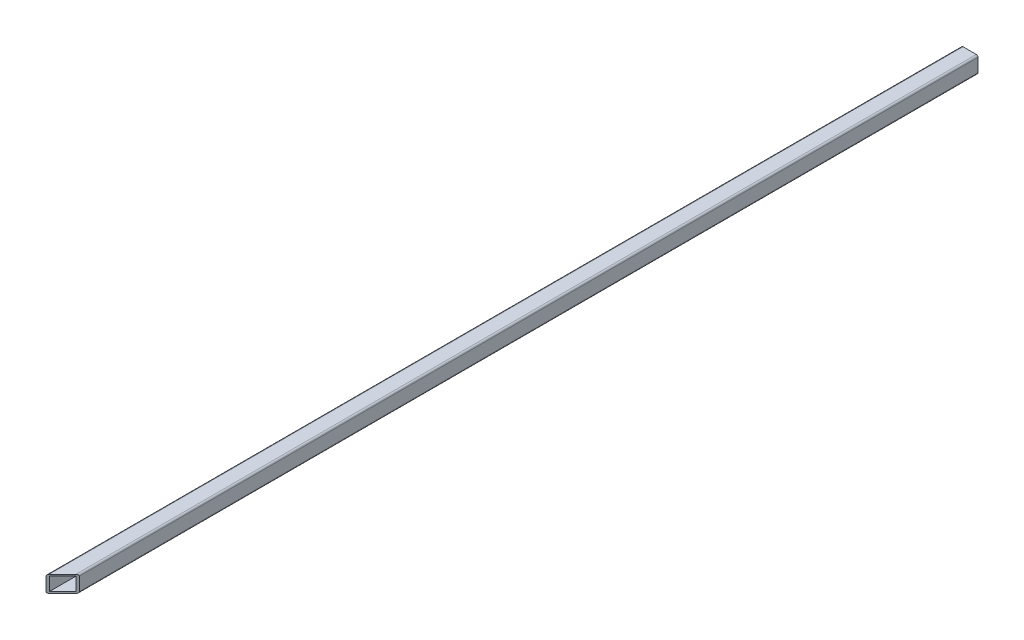
ISO-10303-21;
HEADER;
FILE_DESCRIPTION(('STEP AP214'),'2;1');
FILE_NAME('part.step','',(''),(''),'','','');
FILE_SCHEMA(('AUTOMOTIVE_DESIGN { 1 0 10303 214 1 1 1 1 }'));
ENDSEC;
DATA;
#1=APPLICATION_CONTEXT('core data for automotive mechanical design processes');
#2=APPLICATION_PROTOCOL_DEFINITION('international standard','automotive_design',2000,#1);
#3=PRODUCT_CONTEXT('',#1,'mechanical');
#4=PRODUCT('Part','Part','',(#3));
#5=PRODUCT_RELATED_PRODUCT_CATEGORY('part','',(#4));
#6=PRODUCT_DEFINITION_FORMATION('','',#4);
#7=PRODUCT_DEFINITION_CONTEXT('part definition',#1,'design');
#8=PRODUCT_DEFINITION('design','',#6,#7);
#9=PRODUCT_DEFINITION_SHAPE('','',#8);
#10=(LENGTH_UNIT() NAMED_UNIT(*) SI_UNIT(.MILLI.,.METRE.));
#11=(NAMED_UNIT(*) PLANE_ANGLE_UNIT() SI_UNIT($,.RADIAN.));
#12=(NAMED_UNIT(*) SI_UNIT($,.STERADIAN.) SOLID_ANGLE_UNIT());
#13=UNCERTAINTY_MEASURE_WITH_UNIT(LENGTH_MEASURE(1.E-05),#10,'distance_accuracy_value','');
#14=(GEOMETRIC_REPRESENTATION_CONTEXT(3) GLOBAL_UNCERTAINTY_ASSIGNED_CONTEXT((#13)) GLOBAL_UNIT_ASSIGNED_CONTEXT((#10,
#11,#12)) REPRESENTATION_CONTEXT('',''));
#15=CARTESIAN_POINT('',(0.,0.,0.));
#16=DIRECTION('',(0.,0.,1.));
#17=DIRECTION('',(1.,0.,0.));
#18=AXIS2_PLACEMENT_3D('',#15,#16,#17);
#19=CARTESIAN_POINT('',(269.900000000001,-30.8499999999948,1100.));
#20=DIRECTION('',(1.,0.,0.));
#21=DIRECTION('',(0.,0.,-1.));
#22=AXIS2_PLACEMENT_3D('',#19,#20,#21);
#23=PLANE('',#22);
#24=DIRECTION('',(0.,-1.,0.));
#25=VECTOR('',#24,1.);
#26=CARTESIAN_POINT('',(269.900000000001,-30.8499999999948,1100.));
#27=LINE('',#26,#25);
#28=CARTESIAN_POINT('',(269.900000000001,-32.8499999999948,1100.));
#29=VERTEX_POINT('',#28);
#30=CARTESIAN_POINT('',(269.900000000001,-48.8499999999948,1100.));
#31=VERTEX_POINT('',#30);
#32=EDGE_CURVE('E126',#29,#31,#27,.T.);
#33=ORIENTED_EDGE('',*,*,#32,.F.);
#34=DIRECTION('',(0.,0.,-1.));
#35=VECTOR('',#34,1.);
#36=CARTESIAN_POINT('',(269.900000000001,-32.8499999999948,1100.));
#37=LINE('',#36,#35);
#38=CARTESIAN_POINT('',(269.900000000001,-32.8499999999948,0.));
#39=VERTEX_POINT('',#38);
#40=EDGE_CURVE('E146',#29,#39,#37,.T.);
#41=ORIENTED_EDGE('',*,*,#40,.T.);
#42=DIRECTION('',(0.,-1.,0.));
#43=VECTOR('',#42,1.);
#44=CARTESIAN_POINT('',(269.900000000001,-30.8499999999948,0.));
#45=LINE('',#44,#43);
#46=CARTESIAN_POINT('',(269.900000000001,-48.8499999999948,0.));
#47=VERTEX_POINT('',#46);
#48=EDGE_CURVE('E178',#39,#47,#45,.T.);
#49=ORIENTED_EDGE('',*,*,#48,.T.);
#50=DIRECTION('',(0.,0.,-1.));
#51=VECTOR('',#50,1.);
#52=CARTESIAN_POINT('',(269.900000000001,-48.8499999999948,1100.));
#53=LINE('',#52,#51);
#54=EDGE_CURVE('E151',#47,#31,#53,.F.);
#55=ORIENTED_EDGE('',*,*,#54,.T.);
#56=EDGE_LOOP('',(#33,#41,#49,#55));
#57=FACE_BOUND('',#56,.T.);
#58=ADVANCED_FACE('F37',(#57),#23,.F.);
#59=CARTESIAN_POINT('',(269.900000000001,-50.8499999999948,1100.));
#60=DIRECTION('',(0.,1.,0.));
#61=DIRECTION('',(-1.,0.,0.));
#62=AXIS2_PLACEMENT_3D('',#59,#60,#61);
#63=PLANE('',#62);
#64=DIRECTION('',(0.,0.,-1.));
#65=VECTOR('',#64,1.);
#66=CARTESIAN_POINT('',(287.900000000001,-50.8499999999948,1100.));
#67=LINE('',#66,#65);
#68=CARTESIAN_POINT('',(287.900000000001,-50.8499999999948,0.));
#69=VERTEX_POINT('',#68);
#70=CARTESIAN_POINT('',(287.900000000001,-50.8499999999948,1082.));
#71=VERTEX_POINT('',#70);
#72=EDGE_CURVE('E140',#69,#71,#67,.F.);
#73=ORIENTED_EDGE('',*,*,#72,.T.);
#74=DIRECTION('',(0.707106781186551,0.,-0.707106781186544));
#75=VECTOR('',#74,1.);
#76=CARTESIAN_POINT('',(269.900000000001,-50.8499999999947,1100.));
#77=LINE('',#76,#75);
#78=CARTESIAN_POINT('',(271.900000000001,-50.8499999999948,1098.));
#79=VERTEX_POINT('',#78);
#80=EDGE_CURVE('E52',#79,#71,#77,.T.);
#81=ORIENTED_EDGE('',*,*,#80,.F.);
#82=DIRECTION('',(0.,0.,-1.));
#83=VECTOR('',#82,1.);
#84=CARTESIAN_POINT('',(271.900000000001,-50.8499999999948,1100.));
#85=LINE('',#84,#83);
#86=CARTESIAN_POINT('',(271.900000000001,-50.8499999999948,0.));
#87=VERTEX_POINT('',#86);
#88=EDGE_CURVE('E45',#79,#87,#85,.T.);
#89=ORIENTED_EDGE('',*,*,#88,.T.);
#90=DIRECTION('',(1.,0.,0.));
#91=VECTOR('',#90,1.);
#92=CARTESIAN_POINT('',(269.900000000001,-50.8499999999948,0.));
#93=LINE('',#92,#91);
#94=EDGE_CURVE('E176',#87,#69,#93,.T.);
#95=ORIENTED_EDGE('',*,*,#94,.T.);
#96=EDGE_LOOP('',(#73,#81,#89,#95));
#97=FACE_BOUND('',#96,.T.);
#98=ADVANCED_FACE('F136',(#97),#63,.F.);
#99=CARTESIAN_POINT('',(289.900000000001,-30.8499999999948,1100.));
#100=DIRECTION('',(-1.,0.,0.));
#101=DIRECTION('',(0.,0.,1.));
#102=AXIS2_PLACEMENT_3D('',#99,#100,#101);
#103=PLANE('',#102);
#104=DIRECTION('',(0.,0.,-1.));
#105=VECTOR('',#104,1.);
#106=CARTESIAN_POINT('',(289.900000000001,-32.8499999999948,1100.));
#107=LINE('',#106,#105);
#108=CARTESIAN_POINT('',(289.900000000001,-32.8499999999948,0.));
#109=VERTEX_POINT('',#108);
#110=CARTESIAN_POINT('',(289.900000000001,-32.8499999999948,1080.));
#111=VERTEX_POINT('',#110);
#112=EDGE_CURVE('E153',#109,#111,#107,.F.);
#113=ORIENTED_EDGE('',*,*,#112,.T.);
#114=DIRECTION('',(0.,-1.,0.));
#115=VECTOR('',#114,1.);
#116=CARTESIAN_POINT('',(289.900000000001,-30.8499999999948,1080.));
#117=LINE('',#116,#115);
#118=CARTESIAN_POINT('',(289.900000000001,-48.8499999999948,1080.));
#119=VERTEX_POINT('',#118);
#120=EDGE_CURVE('E217',#111,#119,#117,.T.);
#121=ORIENTED_EDGE('',*,*,#120,.T.);
#122=DIRECTION('',(0.,0.,-1.));
#123=VECTOR('',#122,1.);
#124=CARTESIAN_POINT('',(289.900000000001,-48.8499999999948,1100.));
#125=LINE('',#124,#123);
#126=CARTESIAN_POINT('',(289.900000000001,-48.8499999999948,0.));
#127=VERTEX_POINT('',#126);
#128=EDGE_CURVE('E156',#119,#127,#125,.T.);
#129=ORIENTED_EDGE('',*,*,#128,.T.);
#130=DIRECTION('',(0.,1.,0.));
#131=VECTOR('',#130,1.);
#132=CARTESIAN_POINT('',(289.900000000001,-30.8499999999948,0.));
#133=LINE('',#132,#131);
#134=EDGE_CURVE('E173',#127,#109,#133,.T.);
#135=ORIENTED_EDGE('',*,*,#134,.T.);
#136=EDGE_LOOP('',(#113,#121,#129,#135));
#137=FACE_BOUND('',#136,.T.);
#138=ADVANCED_FACE('F244',(#137),#103,.F.);
#139=CARTESIAN_POINT('',(269.900000000001,-30.8499999999948,1100.));
#140=DIRECTION('',(0.,-1.,0.));
#141=DIRECTION('',(1.,0.,0.));
#142=AXIS2_PLACEMENT_3D('',#139,#140,#141);
#143=PLANE('',#142);
#144=DIRECTION('',(0.,0.,-1.));
#145=VECTOR('',#144,1.);
#146=CARTESIAN_POINT('',(271.900000000001,-30.8499999999948,1100.));
#147=LINE('',#146,#145);
#148=CARTESIAN_POINT('',(271.900000000001,-30.8499999999948,0.));
#149=VERTEX_POINT('',#148);
#150=CARTESIAN_POINT('',(271.900000000001,-30.8499999999948,1098.));
#151=VERTEX_POINT('',#150);
#152=EDGE_CURVE('E167',#149,#151,#147,.F.);
#153=ORIENTED_EDGE('',*,*,#152,.T.);
#154=DIRECTION('',(0.707106781186551,0.,-0.707106781186544));
#155=VECTOR('',#154,1.);
#156=CARTESIAN_POINT('',(269.900000000001,-30.8499999999948,1100.));
#157=LINE('',#156,#155);
#158=CARTESIAN_POINT('',(287.900000000001,-30.8499999999948,1082.));
#159=VERTEX_POINT('',#158);
#160=EDGE_CURVE('E141',#151,#159,#157,.T.);
#161=ORIENTED_EDGE('',*,*,#160,.T.);
#162=DIRECTION('',(0.,0.,-1.));
#163=VECTOR('',#162,1.);
#164=CARTESIAN_POINT('',(287.900000000001,-30.8499999999948,1100.));
#165=LINE('',#164,#163);
#166=CARTESIAN_POINT('',(287.900000000001,-30.8499999999948,0.));
#167=VERTEX_POINT('',#166);
#168=EDGE_CURVE('E165',#159,#167,#165,.T.);
#169=ORIENTED_EDGE('',*,*,#168,.T.);
#170=DIRECTION('',(-1.,0.,0.));
#171=VECTOR('',#170,1.);
#172=CARTESIAN_POINT('',(269.900000000001,-30.8499999999948,0.));
#173=LINE('',#172,#171);
#174=EDGE_CURVE('E170',#167,#149,#173,.T.);
#175=ORIENTED_EDGE('',*,*,#174,.T.);
#176=EDGE_LOOP('',(#153,#161,#169,#175));
#177=FACE_BOUND('',#176,.T.);
#178=ADVANCED_FACE('F223',(#177),#143,.F.);
#179=CARTESIAN_POINT('',(0.,0.,0.));
#180=DIRECTION('',(0.,0.,1.));
#181=DIRECTION('',(1.,0.,0.));
#182=AXIS2_PLACEMENT_3D('',#179,#180,#181);
#183=PLANE('',#182);
#184=DIRECTION('',(0.,1.,0.));
#185=VECTOR('',#184,1.);
#186=CARTESIAN_POINT('',(287.900000000001,-48.8499999999948,0.));
#187=LINE('',#186,#185);
#188=CARTESIAN_POINT('',(287.900000000001,-48.8499999999948,0.));
#189=VERTEX_POINT('',#188);
#190=CARTESIAN_POINT('',(287.900000000001,-32.8499999999948,0.));
#191=VERTEX_POINT('',#190);
#192=EDGE_CURVE('E187',#189,#191,#187,.T.);
#193=ORIENTED_EDGE('',*,*,#192,.T.);
#194=DIRECTION('',(-1.,0.,0.));
#195=VECTOR('',#194,1.);
#196=CARTESIAN_POINT('',(287.900000000001,-32.8499999999948,0.));
#197=LINE('',#196,#195);
#198=CARTESIAN_POINT('',(271.900000000001,-32.8499999999948,0.));
#199=VERTEX_POINT('',#198);
#200=EDGE_CURVE('E203',#191,#199,#197,.T.);
#201=ORIENTED_EDGE('',*,*,#200,.T.);
#202=DIRECTION('',(0.,-1.,0.));
#203=VECTOR('',#202,1.);
#204=CARTESIAN_POINT('',(271.900000000001,-32.8499999999948,0.));
#205=LINE('',#204,#203);
#206=CARTESIAN_POINT('',(271.900000000001,-48.8499999999948,0.));
#207=VERTEX_POINT('',#206);
#208=EDGE_CURVE('E200',#199,#207,#205,.T.);
#209=ORIENTED_EDGE('',*,*,#208,.T.);
#210=DIRECTION('',(1.,0.,0.));
#211=VECTOR('',#210,1.);
#212=CARTESIAN_POINT('',(271.900000000001,-48.8499999999948,0.));
#213=LINE('',#212,#211);
#214=EDGE_CURVE('E197',#207,#189,#213,.T.);
#215=ORIENTED_EDGE('',*,*,#214,.T.);
#216=EDGE_LOOP('',(#193,#201,#209,#215));
#217=FACE_BOUND('',#216,.T.);
#218=ORIENTED_EDGE('',*,*,#174,.F.);
#219=CARTESIAN_POINT('',(287.900000000001,-32.8499999999948,0.));
#220=DIRECTION('',(0.,0.,1.));
#221=DIRECTION('',(1.,0.,0.));
#222=AXIS2_PLACEMENT_3D('',#219,#220,#221);
#223=CIRCLE('',#222,2.);
#224=EDGE_CURVE('E158',#167,#109,#223,.F.);
#225=ORIENTED_EDGE('',*,*,#224,.T.);
#226=ORIENTED_EDGE('',*,*,#134,.F.);
#227=CARTESIAN_POINT('',(287.900000000001,-48.8499999999948,0.));
#228=DIRECTION('',(0.,0.,1.));
#229=DIRECTION('',(1.,0.,0.));
#230=AXIS2_PLACEMENT_3D('',#227,#228,#229);
#231=CIRCLE('',#230,2.);
#232=EDGE_CURVE('E163',#127,#69,#231,.F.);
#233=ORIENTED_EDGE('',*,*,#232,.T.);
#234=ORIENTED_EDGE('',*,*,#94,.F.);
#235=CARTESIAN_POINT('',(271.900000000001,-48.8499999999948,0.));
#236=DIRECTION('',(0.,0.,1.));
#237=DIRECTION('',(1.,0.,0.));
#238=AXIS2_PLACEMENT_3D('',#235,#236,#237);
#239=CIRCLE('',#238,2.);
#240=EDGE_CURVE('E144',#87,#47,#239,.F.);
#241=ORIENTED_EDGE('',*,*,#240,.T.);
#242=ORIENTED_EDGE('',*,*,#48,.F.);
#243=CARTESIAN_POINT('',(271.900000000001,-32.8499999999948,0.));
#244=DIRECTION('',(0.,0.,1.));
#245=DIRECTION('',(1.,0.,0.));
#246=AXIS2_PLACEMENT_3D('',#243,#244,#245);
#247=CIRCLE('',#246,2.);
#248=EDGE_CURVE('E160',#39,#149,#247,.F.);
#249=ORIENTED_EDGE('',*,*,#248,.T.);
#250=EDGE_LOOP('',(#218,#225,#226,#233,#234,#241,#242,#249));
#251=FACE_BOUND('',#250,.T.);
#252=ADVANCED_FACE('F234',(#217,#251),#183,.F.);
#253=CARTESIAN_POINT('',(287.900000000001,-32.8499999999948,1100.));
#254=DIRECTION('',(0.,0.,-1.));
#255=DIRECTION('',(-1.,0.,0.));
#256=AXIS2_PLACEMENT_3D('',#253,#254,#255);
#257=CYLINDRICAL_SURFACE('',#256,2.);
#258=CARTESIAN_POINT('',(287.900000000001,-32.8499999999948,1082.));
#259=DIRECTION('',(-0.707106781186544,0.,-0.707106781186551));
#260=DIRECTION('',(0.707106781186551,0.,-0.707106781186544));
#261=AXIS2_PLACEMENT_3D('',#258,#259,#260);
#262=ELLIPSE('',#261,2.82842712474617,2.);
#263=EDGE_CURVE('E206',#111,#159,#262,.F.);
#264=ORIENTED_EDGE('',*,*,#263,.F.);
#265=ORIENTED_EDGE('',*,*,#112,.F.);
#266=ORIENTED_EDGE('',*,*,#224,.F.);
#267=ORIENTED_EDGE('',*,*,#168,.F.);
#268=EDGE_LOOP('',(#264,#265,#266,#267));
#269=FACE_BOUND('',#268,.T.);
#270=ADVANCED_FACE('F229',(#269),#257,.T.);
#271=CARTESIAN_POINT('',(271.900000000001,-32.8499999999948,1100.));
#272=DIRECTION('',(0.,0.,-1.));
#273=DIRECTION('',(-1.,0.,0.));
#274=AXIS2_PLACEMENT_3D('',#271,#272,#273);
#275=CYLINDRICAL_SURFACE('',#274,2.);
#276=CARTESIAN_POINT('',(271.900000000001,-32.8499999999948,1098.));
#277=DIRECTION('',(-0.707106781186544,0.,-0.707106781186551));
#278=DIRECTION('',(0.707106781186551,0.,-0.707106781186544));
#279=AXIS2_PLACEMENT_3D('',#276,#277,#278);
#280=ELLIPSE('',#279,2.82842712474617,2.);
#281=EDGE_CURVE('E131',#151,#29,#280,.F.);
#282=ORIENTED_EDGE('',*,*,#281,.F.);
#283=ORIENTED_EDGE('',*,*,#152,.F.);
#284=ORIENTED_EDGE('',*,*,#248,.F.);
#285=ORIENTED_EDGE('',*,*,#40,.F.);
#286=EDGE_LOOP('',(#282,#283,#284,#285));
#287=FACE_BOUND('',#286,.T.);
#288=ADVANCED_FACE('F237',(#287),#275,.T.);
#289=CARTESIAN_POINT('',(271.900000000001,-48.8499999999948,1100.));
#290=DIRECTION('',(0.,0.,-1.));
#291=DIRECTION('',(-1.,0.,0.));
#292=AXIS2_PLACEMENT_3D('',#289,#290,#291);
#293=CYLINDRICAL_SURFACE('',#292,2.);
#294=CARTESIAN_POINT('',(271.900000000001,-48.8499999999948,1098.));
#295=DIRECTION('',(-0.707106781186544,0.,-0.707106781186551));
#296=DIRECTION('',(0.707106781186551,0.,-0.707106781186544));
#297=AXIS2_PLACEMENT_3D('',#294,#295,#296);
#298=ELLIPSE('',#297,2.82842712474617,2.);
#299=EDGE_CURVE('E123',#31,#79,#298,.F.);
#300=ORIENTED_EDGE('',*,*,#299,.F.);
#301=ORIENTED_EDGE('',*,*,#54,.F.);
#302=ORIENTED_EDGE('',*,*,#240,.F.);
#303=ORIENTED_EDGE('',*,*,#88,.F.);
#304=EDGE_LOOP('',(#300,#301,#302,#303));
#305=FACE_BOUND('',#304,.T.);
#306=ADVANCED_FACE('F143',(#305),#293,.T.);
#307=CARTESIAN_POINT('',(287.900000000001,-48.8499999999948,1100.));
#308=DIRECTION('',(0.,0.,-1.));
#309=DIRECTION('',(-1.,0.,0.));
#310=AXIS2_PLACEMENT_3D('',#307,#308,#309);
#311=CYLINDRICAL_SURFACE('',#310,2.);
#312=CARTESIAN_POINT('',(287.900000000001,-48.8499999999948,1082.));
#313=DIRECTION('',(-0.707106781186544,0.,-0.707106781186551));
#314=DIRECTION('',(0.707106781186551,0.,-0.707106781186544));
#315=AXIS2_PLACEMENT_3D('',#312,#313,#314);
#316=ELLIPSE('',#315,2.82842712474617,2.);
#317=EDGE_CURVE('E132',#71,#119,#316,.F.);
#318=ORIENTED_EDGE('',*,*,#317,.F.);
#319=ORIENTED_EDGE('',*,*,#72,.F.);
#320=ORIENTED_EDGE('',*,*,#232,.F.);
#321=ORIENTED_EDGE('',*,*,#128,.F.);
#322=EDGE_LOOP('',(#318,#319,#320,#321));
#323=FACE_BOUND('',#322,.T.);
#324=ADVANCED_FACE('F39',(#323),#311,.T.);
#325=CARTESIAN_POINT('',(287.900000000001,-32.8499999999948,0.));
#326=DIRECTION('',(0.,1.,0.));
#327=DIRECTION('',(-1.,0.,0.));
#328=AXIS2_PLACEMENT_3D('',#325,#326,#327);
#329=PLANE('',#328);
#330=DIRECTION('',(0.,0.,1.));
#331=VECTOR('',#330,1.);
#332=CARTESIAN_POINT('',(287.900000000001,-32.8499999999948,0.));
#333=LINE('',#332,#331);
#334=CARTESIAN_POINT('',(287.900000000001,-32.8499999999948,1082.));
#335=VERTEX_POINT('',#334);
#336=EDGE_CURVE('E181',#191,#335,#333,.T.);
#337=ORIENTED_EDGE('',*,*,#336,.T.);
#338=DIRECTION('',(-0.707106781186551,0.,0.707106781186544));
#339=VECTOR('',#338,1.);
#340=CARTESIAN_POINT('',(828.900000000001,-32.8499999999943,541.000000000006));
#341=LINE('',#340,#339);
#342=CARTESIAN_POINT('',(271.900000000001,-32.8499999999948,1098.));
#343=VERTEX_POINT('',#342);
#344=EDGE_CURVE('E210',#335,#343,#341,.T.);
#345=ORIENTED_EDGE('',*,*,#344,.T.);
#346=DIRECTION('',(0.,0.,1.));
#347=VECTOR('',#346,1.);
#348=CARTESIAN_POINT('',(271.900000000001,-32.8499999999948,0.));
#349=LINE('',#348,#347);
#350=EDGE_CURVE('E183',#199,#343,#349,.T.);
#351=ORIENTED_EDGE('',*,*,#350,.F.);
#352=ORIENTED_EDGE('',*,*,#200,.F.);
#353=EDGE_LOOP('',(#337,#345,#351,#352));
#354=FACE_BOUND('',#353,.T.);
#355=ADVANCED_FACE('F266',(#354),#329,.F.);
#356=CARTESIAN_POINT('',(287.900000000001,-48.8499999999948,0.));
#357=DIRECTION('',(1.,0.,0.));
#358=DIRECTION('',(0.,0.,-1.));
#359=AXIS2_PLACEMENT_3D('',#356,#357,#358);
#360=PLANE('',#359);
#361=DIRECTION('',(0.,0.,1.));
#362=VECTOR('',#361,1.);
#363=CARTESIAN_POINT('',(287.900000000001,-48.8499999999948,0.));
#364=LINE('',#363,#362);
#365=CARTESIAN_POINT('',(287.900000000001,-48.8499999999948,1082.));
#366=VERTEX_POINT('',#365);
#367=EDGE_CURVE('E190',#189,#366,#364,.T.);
#368=ORIENTED_EDGE('',*,*,#367,.T.);
#369=DIRECTION('',(0.,1.,0.));
#370=VECTOR('',#369,1.);
#371=CARTESIAN_POINT('',(287.900000000001,-48.8499999999937,1082.));
#372=LINE('',#371,#370);
#373=EDGE_CURVE('E213',#366,#335,#372,.T.);
#374=ORIENTED_EDGE('',*,*,#373,.T.);
#375=ORIENTED_EDGE('',*,*,#336,.F.);
#376=ORIENTED_EDGE('',*,*,#192,.F.);
#377=EDGE_LOOP('',(#368,#374,#375,#376));
#378=FACE_BOUND('',#377,.T.);
#379=ADVANCED_FACE('F270',(#378),#360,.F.);
#380=CARTESIAN_POINT('',(271.900000000001,-48.8499999999948,0.));
#381=DIRECTION('',(0.,-1.,0.));
#382=DIRECTION('',(1.,0.,0.));
#383=AXIS2_PLACEMENT_3D('',#380,#381,#382);
#384=PLANE('',#383);
#385=DIRECTION('',(0.,0.,1.));
#386=VECTOR('',#385,1.);
#387=CARTESIAN_POINT('',(271.900000000001,-48.8499999999948,0.));
#388=LINE('',#387,#386);
#389=CARTESIAN_POINT('',(271.900000000001,-48.8499999999948,1098.));
#390=VERTEX_POINT('',#389);
#391=EDGE_CURVE('E186',#207,#390,#388,.T.);
#392=ORIENTED_EDGE('',*,*,#391,.T.);
#393=DIRECTION('',(0.707106781186551,0.,-0.707106781186544));
#394=VECTOR('',#393,1.);
#395=CARTESIAN_POINT('',(820.900000000001,-48.8499999999944,549.000000000006));
#396=LINE('',#395,#394);
#397=EDGE_CURVE('E60',#390,#366,#396,.T.);
#398=ORIENTED_EDGE('',*,*,#397,.T.);
#399=ORIENTED_EDGE('',*,*,#367,.F.);
#400=ORIENTED_EDGE('',*,*,#214,.F.);
#401=EDGE_LOOP('',(#392,#398,#399,#400));
#402=FACE_BOUND('',#401,.T.);
#403=ADVANCED_FACE('F276',(#402),#384,.F.);
#404=CARTESIAN_POINT('',(271.900000000001,-32.8499999999948,0.));
#405=DIRECTION('',(-1.,0.,0.));
#406=DIRECTION('',(0.,0.,1.));
#407=AXIS2_PLACEMENT_3D('',#404,#405,#406);
#408=PLANE('',#407);
#409=ORIENTED_EDGE('',*,*,#350,.T.);
#410=DIRECTION('',(0.,-1.,0.));
#411=VECTOR('',#410,1.);
#412=CARTESIAN_POINT('',(271.900000000001,-32.8499999999937,1098.));
#413=LINE('',#412,#411);
#414=EDGE_CURVE('E11',#343,#390,#413,.T.);
#415=ORIENTED_EDGE('',*,*,#414,.T.);
#416=ORIENTED_EDGE('',*,*,#391,.F.);
#417=ORIENTED_EDGE('',*,*,#208,.F.);
#418=EDGE_LOOP('',(#409,#415,#416,#417));
#419=FACE_BOUND('',#418,.T.);
#420=ADVANCED_FACE('F281',(#419),#408,.F.);
#421=CARTESIAN_POINT('',(269.900000000001,-30.8499999999948,1100.));
#422=DIRECTION('',(-0.707106781186544,0.,-0.707106781186551));
#423=DIRECTION('',(-0.707106781186551,0.,0.707106781186544));
#424=AXIS2_PLACEMENT_3D('',#421,#422,#423);
#425=PLANE('',#424);
#426=ORIENTED_EDGE('',*,*,#263,.T.);
#427=ORIENTED_EDGE('',*,*,#160,.F.);
#428=ORIENTED_EDGE('',*,*,#281,.T.);
#429=ORIENTED_EDGE('',*,*,#32,.T.);
#430=ORIENTED_EDGE('',*,*,#299,.T.);
#431=ORIENTED_EDGE('',*,*,#80,.T.);
#432=ORIENTED_EDGE('',*,*,#317,.T.);
#433=ORIENTED_EDGE('',*,*,#120,.F.);
#434=EDGE_LOOP('',(#426,#427,#428,#429,#430,#431,#432,#433));
#435=FACE_BOUND('',#434,.T.);
#436=ORIENTED_EDGE('',*,*,#373,.F.);
#437=ORIENTED_EDGE('',*,*,#397,.F.);
#438=ORIENTED_EDGE('',*,*,#414,.F.);
#439=ORIENTED_EDGE('',*,*,#344,.F.);
#440=EDGE_LOOP('',(#436,#437,#438,#439));
#441=FACE_BOUND('',#440,.T.);
#442=ADVANCED_FACE('F124',(#435,#441),#425,.F.);
#443=CLOSED_SHELL('',(#58,#98,#138,#178,#252,#270,#288,#306,#324,#355,#379,#403,#420,#442));
#444=MANIFOLD_SOLID_BREP('B2',#443);
#445=ADVANCED_BREP_SHAPE_REPRESENTATION('',(#18,#444),#14);
#446=SHAPE_DEFINITION_REPRESENTATION(#9,#445);
ENDSEC;
END-ISO-10303-21;
